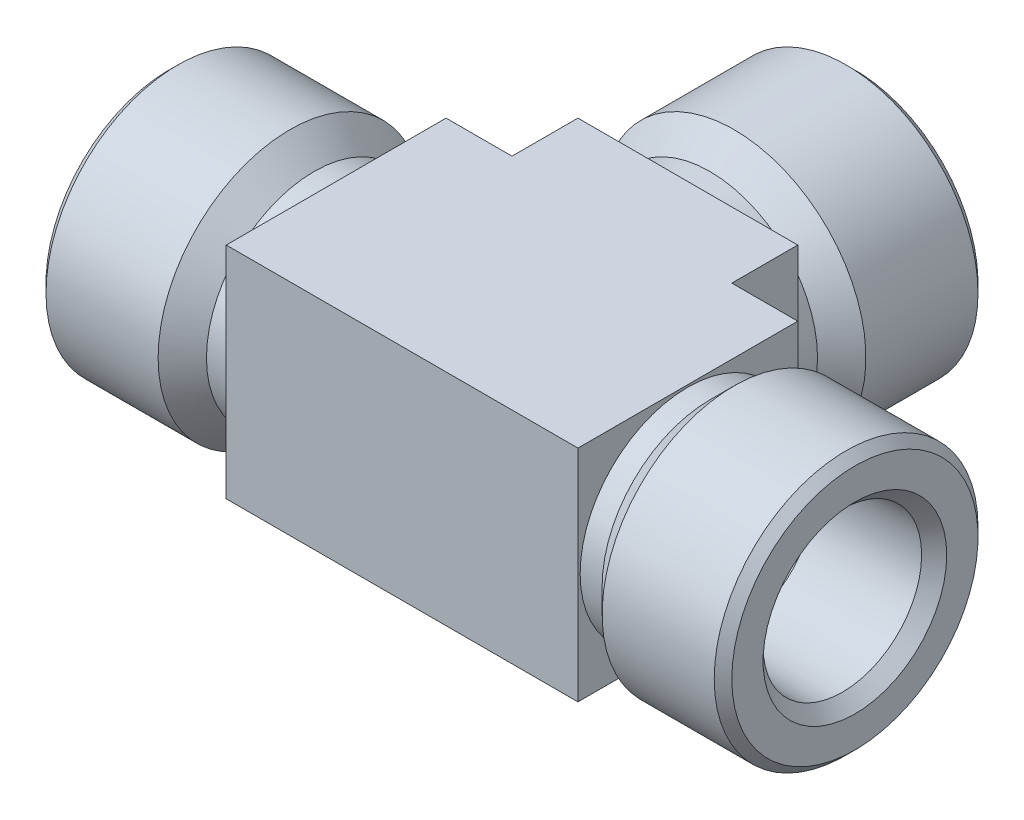
ISO-10303-21;
HEADER;
FILE_DESCRIPTION(('STEP AP214'),'2;1');
FILE_NAME('part.step','',(''),(''),'','','');
FILE_SCHEMA(('AUTOMOTIVE_DESIGN { 1 0 10303 214 1 1 1 1 }'));
ENDSEC;
DATA;
#1=APPLICATION_CONTEXT('core data for automotive mechanical design processes');
#2=APPLICATION_PROTOCOL_DEFINITION('international standard','automotive_design',2000,#1);
#3=PRODUCT_CONTEXT('',#1,'mechanical');
#4=PRODUCT('Part','Part','',(#3));
#5=PRODUCT_RELATED_PRODUCT_CATEGORY('part','',(#4));
#6=PRODUCT_DEFINITION_FORMATION('','',#4);
#7=PRODUCT_DEFINITION_CONTEXT('part definition',#1,'design');
#8=PRODUCT_DEFINITION('design','',#6,#7);
#9=PRODUCT_DEFINITION_SHAPE('','',#8);
#10=(LENGTH_UNIT() NAMED_UNIT(*) SI_UNIT(.MILLI.,.METRE.));
#11=(NAMED_UNIT(*) PLANE_ANGLE_UNIT() SI_UNIT($,.RADIAN.));
#12=(NAMED_UNIT(*) SI_UNIT($,.STERADIAN.) SOLID_ANGLE_UNIT());
#13=UNCERTAINTY_MEASURE_WITH_UNIT(LENGTH_MEASURE(1.E-05),#10,'distance_accuracy_value','');
#14=(GEOMETRIC_REPRESENTATION_CONTEXT(3) GLOBAL_UNCERTAINTY_ASSIGNED_CONTEXT((#13)) GLOBAL_UNIT_ASSIGNED_CONTEXT((#10,
#11,#12)) REPRESENTATION_CONTEXT('',''));
#15=CARTESIAN_POINT('',(0.,0.,0.));
#16=DIRECTION('',(0.,0.,1.));
#17=DIRECTION('',(1.,0.,0.));
#18=AXIS2_PLACEMENT_3D('',#15,#16,#17);
#19=CARTESIAN_POINT('',(26.924,12.7,0.));
#20=DIRECTION('',(-1.,0.,0.));
#21=DIRECTION('',(0.,0.,1.));
#22=AXIS2_PLACEMENT_3D('',#19,#20,#21);
#23=PLANE('',#22);
#24=DIRECTION('',(0.,1.,0.));
#25=VECTOR('',#24,1.);
#26=CARTESIAN_POINT('',(26.924,12.7,-12.7));
#27=LINE('',#26,#25);
#28=CARTESIAN_POINT('',(26.924,12.7,-12.7));
#29=VERTEX_POINT('',#28);
#30=CARTESIAN_POINT('',(26.924,-12.7,-12.7));
#31=VERTEX_POINT('',#30);
#32=EDGE_CURVE('E159',#29,#31,#27,.F.);
#33=ORIENTED_EDGE('',*,*,#32,.F.);
#34=DIRECTION('',(0.,0.,1.));
#35=VECTOR('',#34,1.);
#36=CARTESIAN_POINT('',(26.924,12.7,12.7));
#37=LINE('',#36,#35);
#38=CARTESIAN_POINT('',(26.924,12.7,-20.32));
#39=VERTEX_POINT('',#38);
#40=EDGE_CURVE('E149',#39,#29,#37,.T.);
#41=ORIENTED_EDGE('',*,*,#40,.F.);
#42=DIRECTION('',(0.,1.,0.));
#43=VECTOR('',#42,1.);
#44=CARTESIAN_POINT('',(26.924,0.,-20.32));
#45=LINE('',#44,#43);
#46=CARTESIAN_POINT('',(26.924,-12.7,-20.32));
#47=VERTEX_POINT('',#46);
#48=EDGE_CURVE('E163',#47,#39,#45,.T.);
#49=ORIENTED_EDGE('',*,*,#48,.F.);
#50=DIRECTION('',(0.,0.,1.));
#51=VECTOR('',#50,1.);
#52=CARTESIAN_POINT('',(26.924,-12.7,-12.7));
#53=LINE('',#52,#51);
#54=EDGE_CURVE('E145',#31,#47,#53,.F.);
#55=ORIENTED_EDGE('',*,*,#54,.F.);
#56=EDGE_LOOP('',(#33,#41,#49,#55));
#57=FACE_BOUND('',#56,.T.);
#58=ADVANCED_FACE('F17',(#57),#23,.T.);
#59=CARTESIAN_POINT('',(52.324,-12.7,0.));
#60=DIRECTION('',(1.,0.,0.));
#61=DIRECTION('',(0.,0.,-1.));
#62=AXIS2_PLACEMENT_3D('',#59,#60,#61);
#63=PLANE('',#62);
#64=DIRECTION('',(0.,1.,0.));
#65=VECTOR('',#64,1.);
#66=CARTESIAN_POINT('',(52.324,0.,-20.32));
#67=LINE('',#66,#65);
#68=CARTESIAN_POINT('',(52.324,12.7,-20.32));
#69=VERTEX_POINT('',#68);
#70=CARTESIAN_POINT('',(52.324,-12.7,-20.32));
#71=VERTEX_POINT('',#70);
#72=EDGE_CURVE('E161',#69,#71,#67,.F.);
#73=ORIENTED_EDGE('',*,*,#72,.F.);
#74=DIRECTION('',(0.,0.,1.));
#75=VECTOR('',#74,1.);
#76=CARTESIAN_POINT('',(52.324,12.7,12.7));
#77=LINE('',#76,#75);
#78=CARTESIAN_POINT('',(52.324,12.7,-12.7));
#79=VERTEX_POINT('',#78);
#80=EDGE_CURVE('E155',#79,#69,#77,.F.);
#81=ORIENTED_EDGE('',*,*,#80,.F.);
#82=DIRECTION('',(0.,1.,0.));
#83=VECTOR('',#82,1.);
#84=CARTESIAN_POINT('',(52.324,12.7,-12.7));
#85=LINE('',#84,#83);
#86=CARTESIAN_POINT('',(52.324,-12.7,-12.7));
#87=VERTEX_POINT('',#86);
#88=EDGE_CURVE('E135',#87,#79,#85,.T.);
#89=ORIENTED_EDGE('',*,*,#88,.F.);
#90=DIRECTION('',(0.,0.,1.));
#91=VECTOR('',#90,1.);
#92=CARTESIAN_POINT('',(52.324,-12.7,-12.7));
#93=LINE('',#92,#91);
#94=EDGE_CURVE('E103',#71,#87,#93,.T.);
#95=ORIENTED_EDGE('',*,*,#94,.F.);
#96=EDGE_LOOP('',(#73,#81,#89,#95));
#97=FACE_BOUND('',#96,.T.);
#98=ADVANCED_FACE('F342',(#97),#63,.T.);
#99=CARTESIAN_POINT('',(45.974,0.,-20.32));
#100=DIRECTION('',(0.,0.,-1.));
#101=DIRECTION('',(-1.,0.,0.));
#102=AXIS2_PLACEMENT_3D('',#99,#100,#101);
#103=PLANE('',#102);
#104=DIRECTION('',(-1.,0.,0.));
#105=VECTOR('',#104,1.);
#106=CARTESIAN_POINT('',(19.304,12.7,-20.32));
#107=LINE('',#106,#105);
#108=EDGE_CURVE('E152',#69,#39,#107,.T.);
#109=ORIENTED_EDGE('',*,*,#108,.F.);
#110=ORIENTED_EDGE('',*,*,#72,.T.);
#111=DIRECTION('',(1.,0.,0.));
#112=VECTOR('',#111,1.);
#113=CARTESIAN_POINT('',(19.304,-12.7,-20.32));
#114=LINE('',#113,#112);
#115=EDGE_CURVE('E143',#47,#71,#114,.T.);
#116=ORIENTED_EDGE('',*,*,#115,.F.);
#117=ORIENTED_EDGE('',*,*,#48,.T.);
#118=EDGE_LOOP('',(#109,#110,#116,#117));
#119=FACE_BOUND('',#118,.T.);
#120=CARTESIAN_POINT('',(39.624,0.,-20.32));
#121=DIRECTION('',(0.,0.,-1.));
#122=DIRECTION('',(-1.,0.,0.));
#123=AXIS2_PLACEMENT_3D('',#120,#121,#122);
#124=CIRCLE('',#123,12.446);
#125=CARTESIAN_POINT('',(27.178,0.,-20.32));
#126=VERTEX_POINT('',#125);
#127=EDGE_CURVE('E20',#126,#126,#124,.T.);
#128=ORIENTED_EDGE('',*,*,#127,.F.);
#129=EDGE_LOOP('',(#128));
#130=FACE_BOUND('',#129,.T.);
#131=ADVANCED_FACE('F339',(#119,#130),#103,.T.);
#132=CARTESIAN_POINT('',(19.304,12.7,-12.7));
#133=DIRECTION('',(0.,0.,-1.));
#134=DIRECTION('',(-1.,0.,0.));
#135=AXIS2_PLACEMENT_3D('',#132,#133,#134);
#136=PLANE('',#135);
#137=DIRECTION('',(0.,1.,0.));
#138=VECTOR('',#137,1.);
#139=CARTESIAN_POINT('',(19.304,0.,-12.7));
#140=LINE('',#139,#138);
#141=CARTESIAN_POINT('',(19.304,12.7,-12.7));
#142=VERTEX_POINT('',#141);
#143=CARTESIAN_POINT('',(19.304,-12.7,-12.7));
#144=VERTEX_POINT('',#143);
#145=EDGE_CURVE('E122',#142,#144,#140,.F.);
#146=ORIENTED_EDGE('',*,*,#145,.F.);
#147=DIRECTION('',(-1.,0.,0.));
#148=VECTOR('',#147,1.);
#149=CARTESIAN_POINT('',(19.304,12.7,-12.7));
#150=LINE('',#149,#148);
#151=EDGE_CURVE('E157',#29,#142,#150,.T.);
#152=ORIENTED_EDGE('',*,*,#151,.F.);
#153=ORIENTED_EDGE('',*,*,#32,.T.);
#154=DIRECTION('',(1.,0.,0.));
#155=VECTOR('',#154,1.);
#156=CARTESIAN_POINT('',(19.304,-12.7,-12.7));
#157=LINE('',#156,#155);
#158=EDGE_CURVE('E137',#144,#31,#157,.T.);
#159=ORIENTED_EDGE('',*,*,#158,.F.);
#160=EDGE_LOOP('',(#146,#152,#153,#159));
#161=FACE_BOUND('',#160,.T.);
#162=ADVANCED_FACE('F341',(#161),#136,.T.);
#163=CARTESIAN_POINT('',(19.304,12.7,12.7));
#164=DIRECTION('',(0.,1.,0.));
#165=DIRECTION('',(-1.,0.,0.));
#166=AXIS2_PLACEMENT_3D('',#163,#164,#165);
#167=PLANE('',#166);
#168=ORIENTED_EDGE('',*,*,#108,.T.);
#169=ORIENTED_EDGE('',*,*,#40,.T.);
#170=ORIENTED_EDGE('',*,*,#151,.T.);
#171=DIRECTION('',(0.,0.,1.));
#172=VECTOR('',#171,1.);
#173=CARTESIAN_POINT('',(19.304,12.7,-6.35));
#174=LINE('',#173,#172);
#175=CARTESIAN_POINT('',(19.304,12.7,12.7));
#176=VERTEX_POINT('',#175);
#177=EDGE_CURVE('E125',#176,#142,#174,.F.);
#178=ORIENTED_EDGE('',*,*,#177,.F.);
#179=DIRECTION('',(1.,0.,0.));
#180=VECTOR('',#179,1.);
#181=CARTESIAN_POINT('',(19.304,12.7,12.7));
#182=LINE('',#181,#180);
#183=CARTESIAN_POINT('',(59.944,12.7,12.7));
#184=VERTEX_POINT('',#183);
#185=EDGE_CURVE('E147',#184,#176,#182,.F.);
#186=ORIENTED_EDGE('',*,*,#185,.F.);
#187=DIRECTION('',(0.,0.,-1.));
#188=VECTOR('',#187,1.);
#189=CARTESIAN_POINT('',(59.944,12.7,-6.35));
#190=LINE('',#189,#188);
#191=CARTESIAN_POINT('',(59.944,12.7,-12.7));
#192=VERTEX_POINT('',#191);
#193=EDGE_CURVE('E120',#192,#184,#190,.F.);
#194=ORIENTED_EDGE('',*,*,#193,.F.);
#195=DIRECTION('',(-1.,0.,0.));
#196=VECTOR('',#195,1.);
#197=CARTESIAN_POINT('',(19.304,12.7,-12.7));
#198=LINE('',#197,#196);
#199=EDGE_CURVE('E106',#79,#192,#198,.F.);
#200=ORIENTED_EDGE('',*,*,#199,.F.);
#201=ORIENTED_EDGE('',*,*,#80,.T.);
#202=EDGE_LOOP('',(#168,#169,#170,#178,#186,#194,#200,#201));
#203=FACE_BOUND('',#202,.T.);
#204=ADVANCED_FACE('F349',(#203),#167,.T.);
#205=CARTESIAN_POINT('',(19.304,-12.7,12.7));
#206=DIRECTION('',(0.,0.,1.));
#207=DIRECTION('',(1.,0.,0.));
#208=AXIS2_PLACEMENT_3D('',#205,#206,#207);
#209=PLANE('',#208);
#210=DIRECTION('',(0.,1.,0.));
#211=VECTOR('',#210,1.);
#212=CARTESIAN_POINT('',(59.944,0.,12.7));
#213=LINE('',#212,#211);
#214=CARTESIAN_POINT('',(59.944,-12.7,12.7));
#215=VERTEX_POINT('',#214);
#216=EDGE_CURVE('E93',#184,#215,#213,.F.);
#217=ORIENTED_EDGE('',*,*,#216,.F.);
#218=ORIENTED_EDGE('',*,*,#185,.T.);
#219=DIRECTION('',(0.,1.,0.));
#220=VECTOR('',#219,1.);
#221=CARTESIAN_POINT('',(19.304,0.,12.7));
#222=LINE('',#221,#220);
#223=CARTESIAN_POINT('',(19.304,-12.7,12.7));
#224=VERTEX_POINT('',#223);
#225=EDGE_CURVE('E128',#224,#176,#222,.T.);
#226=ORIENTED_EDGE('',*,*,#225,.F.);
#227=DIRECTION('',(1.,0.,0.));
#228=VECTOR('',#227,1.);
#229=CARTESIAN_POINT('',(19.304,-12.7,12.7));
#230=LINE('',#229,#228);
#231=EDGE_CURVE('E140',#215,#224,#230,.F.);
#232=ORIENTED_EDGE('',*,*,#231,.F.);
#233=EDGE_LOOP('',(#217,#218,#226,#232));
#234=FACE_BOUND('',#233,.T.);
#235=ADVANCED_FACE('F357',(#234),#209,.T.);
#236=CARTESIAN_POINT('',(19.304,-12.7,-12.7));
#237=DIRECTION('',(0.,-1.,0.));
#238=DIRECTION('',(1.,0.,0.));
#239=AXIS2_PLACEMENT_3D('',#236,#237,#238);
#240=PLANE('',#239);
#241=DIRECTION('',(0.,0.,1.));
#242=VECTOR('',#241,1.);
#243=CARTESIAN_POINT('',(19.304,-12.7,-6.35));
#244=LINE('',#243,#242);
#245=EDGE_CURVE('E131',#144,#224,#244,.T.);
#246=ORIENTED_EDGE('',*,*,#245,.F.);
#247=ORIENTED_EDGE('',*,*,#158,.T.);
#248=ORIENTED_EDGE('',*,*,#54,.T.);
#249=ORIENTED_EDGE('',*,*,#115,.T.);
#250=ORIENTED_EDGE('',*,*,#94,.T.);
#251=DIRECTION('',(-1.,0.,0.));
#252=VECTOR('',#251,1.);
#253=CARTESIAN_POINT('',(19.304,-12.7,-12.7));
#254=LINE('',#253,#252);
#255=CARTESIAN_POINT('',(59.944,-12.7,-12.7));
#256=VERTEX_POINT('',#255);
#257=EDGE_CURVE('E98',#256,#87,#254,.T.);
#258=ORIENTED_EDGE('',*,*,#257,.F.);
#259=DIRECTION('',(0.,0.,-1.));
#260=VECTOR('',#259,1.);
#261=CARTESIAN_POINT('',(59.944,-12.7,-6.35));
#262=LINE('',#261,#260);
#263=EDGE_CURVE('E85',#215,#256,#262,.T.);
#264=ORIENTED_EDGE('',*,*,#263,.F.);
#265=ORIENTED_EDGE('',*,*,#231,.T.);
#266=EDGE_LOOP('',(#246,#247,#248,#249,#250,#258,#264,#265));
#267=FACE_BOUND('',#266,.T.);
#268=ADVANCED_FACE('F100',(#267),#240,.T.);
#269=CARTESIAN_POINT('',(19.304,12.7,-12.7));
#270=DIRECTION('',(0.,0.,-1.));
#271=DIRECTION('',(-1.,0.,0.));
#272=AXIS2_PLACEMENT_3D('',#269,#270,#271);
#273=PLANE('',#272);
#274=DIRECTION('',(0.,1.,0.));
#275=VECTOR('',#274,1.);
#276=CARTESIAN_POINT('',(59.944,0.,-12.7));
#277=LINE('',#276,#275);
#278=EDGE_CURVE('E90',#256,#192,#277,.T.);
#279=ORIENTED_EDGE('',*,*,#278,.F.);
#280=ORIENTED_EDGE('',*,*,#257,.T.);
#281=ORIENTED_EDGE('',*,*,#88,.T.);
#282=ORIENTED_EDGE('',*,*,#199,.T.);
#283=EDGE_LOOP('',(#279,#280,#281,#282));
#284=FACE_BOUND('',#283,.T.);
#285=ADVANCED_FACE('F108',(#284),#273,.T.);
#286=CARTESIAN_POINT('',(39.624,0.,-21.59));
#287=DIRECTION('',(0.,0.,-1.));
#288=DIRECTION('',(-1.,0.,0.));
#289=AXIS2_PLACEMENT_3D('',#286,#287,#288);
#290=CYLINDRICAL_SURFACE('',#289,12.446);
#291=CARTESIAN_POINT('',(39.624,0.,-22.86));
#292=DIRECTION('',(0.,0.,-1.));
#293=DIRECTION('',(1.,0.,0.));
#294=AXIS2_PLACEMENT_3D('',#291,#292,#293);
#295=CIRCLE('',#294,12.446);
#296=CARTESIAN_POINT('',(52.07,0.,-22.86));
#297=VERTEX_POINT('',#296);
#298=EDGE_CURVE('E110',#297,#297,#295,.T.);
#299=ORIENTED_EDGE('',*,*,#298,.F.);
#300=EDGE_LOOP('',(#299));
#301=FACE_BOUND('',#300,.T.);
#302=ORIENTED_EDGE('',*,*,#127,.T.);
#303=EDGE_LOOP('',(#302));
#304=FACE_BOUND('',#303,.T.);
#305=ADVANCED_FACE('F216',(#301,#304),#290,.T.);
#306=CARTESIAN_POINT('',(19.304,0.,-6.35));
#307=DIRECTION('',(-1.,0.,0.));
#308=DIRECTION('',(0.,0.,1.));
#309=AXIS2_PLACEMENT_3D('',#306,#307,#308);
#310=PLANE('',#309);
#311=ORIENTED_EDGE('',*,*,#177,.T.);
#312=ORIENTED_EDGE('',*,*,#145,.T.);
#313=ORIENTED_EDGE('',*,*,#245,.T.);
#314=ORIENTED_EDGE('',*,*,#225,.T.);
#315=EDGE_LOOP('',(#311,#312,#313,#314));
#316=FACE_BOUND('',#315,.T.);
#317=CARTESIAN_POINT('',(19.304,0.,0.));
#318=DIRECTION('',(-1.,0.,0.));
#319=DIRECTION('',(0.,0.,1.));
#320=AXIS2_PLACEMENT_3D('',#317,#318,#319);
#321=CIRCLE('',#320,12.446);
#322=CARTESIAN_POINT('',(19.304,0.,12.446));
#323=VERTEX_POINT('',#322);
#324=EDGE_CURVE('E113',#323,#323,#321,.T.);
#325=ORIENTED_EDGE('',*,*,#324,.F.);
#326=EDGE_LOOP('',(#325));
#327=FACE_BOUND('',#326,.T.);
#328=ADVANCED_FACE('F214',(#316,#327),#310,.T.);
#329=CARTESIAN_POINT('',(59.944,0.,-6.35));
#330=DIRECTION('',(1.,0.,0.));
#331=DIRECTION('',(0.,0.,-1.));
#332=AXIS2_PLACEMENT_3D('',#329,#330,#331);
#333=PLANE('',#332);
#334=ORIENTED_EDGE('',*,*,#263,.T.);
#335=ORIENTED_EDGE('',*,*,#278,.T.);
#336=ORIENTED_EDGE('',*,*,#193,.T.);
#337=ORIENTED_EDGE('',*,*,#216,.T.);
#338=EDGE_LOOP('',(#334,#335,#336,#337));
#339=FACE_BOUND('',#338,.T.);
#340=CARTESIAN_POINT('',(59.944,0.,0.));
#341=DIRECTION('',(1.,0.,0.));
#342=DIRECTION('',(0.,0.,-1.));
#343=AXIS2_PLACEMENT_3D('',#340,#341,#342);
#344=CIRCLE('',#343,12.446);
#345=CARTESIAN_POINT('',(59.944,0.,-12.446));
#346=VERTEX_POINT('',#345);
#347=EDGE_CURVE('E206',#346,#346,#344,.T.);
#348=ORIENTED_EDGE('',*,*,#347,.F.);
#349=EDGE_LOOP('',(#348));
#350=FACE_BOUND('',#349,.T.);
#351=ADVANCED_FACE('F87',(#339,#350),#333,.T.);
#352=CARTESIAN_POINT('',(39.624,0.,-25.654));
#353=DIRECTION('',(0.,0.,-1.));
#354=DIRECTION('',(0.,1.,0.));
#355=AXIS2_PLACEMENT_3D('',#352,#353,#354);
#356=CONICAL_SURFACE('',#355,15.24,0.785398163397448);
#357=CARTESIAN_POINT('',(39.624,0.,-25.654));
#358=DIRECTION('',(0.,0.,-1.));
#359=DIRECTION('',(-1.,0.,0.));
#360=AXIS2_PLACEMENT_3D('',#357,#358,#359);
#361=CIRCLE('',#360,15.24);
#362=CARTESIAN_POINT('',(24.384,0.,-25.654));
#363=VERTEX_POINT('',#362);
#364=EDGE_CURVE('E116',#363,#363,#361,.T.);
#365=ORIENTED_EDGE('',*,*,#364,.F.);
#366=EDGE_LOOP('',(#365));
#367=FACE_BOUND('',#366,.T.);
#368=ORIENTED_EDGE('',*,*,#298,.T.);
#369=EDGE_LOOP('',(#368));
#370=FACE_BOUND('',#369,.T.);
#371=ADVANCED_FACE('F224',(#367,#370),#356,.T.);
#372=CARTESIAN_POINT('',(18.034,0.,0.));
#373=DIRECTION('',(-1.,0.,0.));
#374=DIRECTION('',(0.,0.,1.));
#375=AXIS2_PLACEMENT_3D('',#372,#373,#374);
#376=CYLINDRICAL_SURFACE('',#375,12.446);
#377=ORIENTED_EDGE('',*,*,#324,.T.);
#378=EDGE_LOOP('',(#377));
#379=FACE_BOUND('',#378,.T.);
#380=CARTESIAN_POINT('',(16.764,0.,0.));
#381=DIRECTION('',(-1.,0.,0.));
#382=DIRECTION('',(0.,0.,-1.));
#383=AXIS2_PLACEMENT_3D('',#380,#381,#382);
#384=CIRCLE('',#383,12.446);
#385=CARTESIAN_POINT('',(16.764,0.,-12.446));
#386=VERTEX_POINT('',#385);
#387=EDGE_CURVE('E771',#386,#386,#384,.T.);
#388=ORIENTED_EDGE('',*,*,#387,.F.);
#389=EDGE_LOOP('',(#388));
#390=FACE_BOUND('',#389,.T.);
#391=ADVANCED_FACE('F211',(#379,#390),#376,.T.);
#392=CARTESIAN_POINT('',(61.214,0.,0.));
#393=DIRECTION('',(1.,0.,0.));
#394=DIRECTION('',(0.,0.,-1.));
#395=AXIS2_PLACEMENT_3D('',#392,#393,#394);
#396=CYLINDRICAL_SURFACE('',#395,12.446);
#397=ORIENTED_EDGE('',*,*,#347,.T.);
#398=EDGE_LOOP('',(#397));
#399=FACE_BOUND('',#398,.T.);
#400=CARTESIAN_POINT('',(62.484,0.,0.));
#401=DIRECTION('',(1.,0.,0.));
#402=DIRECTION('',(0.,0.,1.));
#403=AXIS2_PLACEMENT_3D('',#400,#401,#402);
#404=CIRCLE('',#403,12.446);
#405=CARTESIAN_POINT('',(62.484,0.,12.446));
#406=VERTEX_POINT('',#405);
#407=EDGE_CURVE('E773',#406,#406,#404,.T.);
#408=ORIENTED_EDGE('',*,*,#407,.F.);
#409=EDGE_LOOP('',(#408));
#410=FACE_BOUND('',#409,.T.);
#411=ADVANCED_FACE('F320',(#399,#410),#396,.T.);
#412=CARTESIAN_POINT('',(39.624,0.,-31.242));
#413=DIRECTION('',(0.,0.,-1.));
#414=DIRECTION('',(-1.,0.,0.));
#415=AXIS2_PLACEMENT_3D('',#412,#413,#414);
#416=CYLINDRICAL_SURFACE('',#415,15.24);
#417=CARTESIAN_POINT('',(39.624,0.,-38.608));
#418=DIRECTION('',(0.,0.,1.));
#419=DIRECTION('',(1.,0.,0.));
#420=AXIS2_PLACEMENT_3D('',#417,#418,#419);
#421=CIRCLE('',#420,15.24);
#422=CARTESIAN_POINT('',(54.864,0.,-38.608));
#423=VERTEX_POINT('',#422);
#424=EDGE_CURVE('E776',#423,#423,#421,.F.);
#425=ORIENTED_EDGE('',*,*,#424,.F.);
#426=EDGE_LOOP('',(#425));
#427=FACE_BOUND('',#426,.T.);
#428=ORIENTED_EDGE('',*,*,#364,.T.);
#429=EDGE_LOOP('',(#428));
#430=FACE_BOUND('',#429,.T.);
#431=ADVANCED_FACE('F316',(#427,#430),#416,.T.);
#432=CARTESIAN_POINT('',(13.97,0.,0.));
#433=DIRECTION('',(-1.,0.,0.));
#434=DIRECTION('',(0.,0.,1.));
#435=AXIS2_PLACEMENT_3D('',#432,#433,#434);
#436=CONICAL_SURFACE('',#435,15.24,0.785398163397447);
#437=ORIENTED_EDGE('',*,*,#387,.T.);
#438=EDGE_LOOP('',(#437));
#439=FACE_BOUND('',#438,.T.);
#440=CARTESIAN_POINT('',(13.97,0.,0.));
#441=DIRECTION('',(-1.,0.,0.));
#442=DIRECTION('',(0.,0.,1.));
#443=AXIS2_PLACEMENT_3D('',#440,#441,#442);
#444=CIRCLE('',#443,15.24);
#445=CARTESIAN_POINT('',(13.97,0.,15.24));
#446=VERTEX_POINT('',#445);
#447=EDGE_CURVE('E781',#446,#446,#444,.T.);
#448=ORIENTED_EDGE('',*,*,#447,.F.);
#449=EDGE_LOOP('',(#448));
#450=FACE_BOUND('',#449,.T.);
#451=ADVANCED_FACE('F312',(#439,#450),#436,.T.);
#452=CARTESIAN_POINT('',(65.278,0.,0.));
#453=DIRECTION('',(1.,0.,0.));
#454=DIRECTION('',(0.,0.,-1.));
#455=AXIS2_PLACEMENT_3D('',#452,#453,#454);
#456=CONICAL_SURFACE('',#455,15.24,0.785398163397448);
#457=ORIENTED_EDGE('',*,*,#407,.T.);
#458=EDGE_LOOP('',(#457));
#459=FACE_BOUND('',#458,.T.);
#460=CARTESIAN_POINT('',(65.278,0.,0.));
#461=DIRECTION('',(1.,0.,0.));
#462=DIRECTION('',(0.,0.,-1.));
#463=AXIS2_PLACEMENT_3D('',#460,#461,#462);
#464=CIRCLE('',#463,15.24);
#465=CARTESIAN_POINT('',(65.278,0.,-15.24));
#466=VERTEX_POINT('',#465);
#467=EDGE_CURVE('E205',#466,#466,#464,.T.);
#468=ORIENTED_EDGE('',*,*,#467,.F.);
#469=EDGE_LOOP('',(#468));
#470=FACE_BOUND('',#469,.T.);
#471=ADVANCED_FACE('F308',(#459,#470),#456,.T.);
#472=CARTESIAN_POINT('',(39.624,0.,-38.608));
#473=DIRECTION('',(0.,0.,1.));
#474=DIRECTION('',(0.,-1.,0.));
#475=AXIS2_PLACEMENT_3D('',#472,#473,#474);
#476=CONICAL_SURFACE('',#475,15.24,0.785398163397448);
#477=CARTESIAN_POINT('',(39.624,0.,-39.624));
#478=DIRECTION('',(0.,0.,1.));
#479=DIRECTION('',(0.,-1.,0.));
#480=AXIS2_PLACEMENT_3D('',#477,#478,#479);
#481=CIRCLE('',#480,14.224);
#482=CARTESIAN_POINT('',(39.624,-14.224,-39.624));
#483=VERTEX_POINT('',#482);
#484=EDGE_CURVE('E201',#483,#483,#481,.F.);
#485=ORIENTED_EDGE('',*,*,#484,.F.);
#486=EDGE_LOOP('',(#485));
#487=FACE_BOUND('',#486,.T.);
#488=ORIENTED_EDGE('',*,*,#424,.T.);
#489=EDGE_LOOP('',(#488));
#490=FACE_BOUND('',#489,.T.);
#491=ADVANCED_FACE('F304',(#487,#490),#476,.T.);
#492=CARTESIAN_POINT('',(8.382,0.,0.));
#493=DIRECTION('',(-1.,0.,0.));
#494=DIRECTION('',(0.,0.,1.));
#495=AXIS2_PLACEMENT_3D('',#492,#493,#494);
#496=CYLINDRICAL_SURFACE('',#495,15.24);
#497=ORIENTED_EDGE('',*,*,#447,.T.);
#498=EDGE_LOOP('',(#497));
#499=FACE_BOUND('',#498,.T.);
#500=CARTESIAN_POINT('',(1.016,0.,0.));
#501=DIRECTION('',(1.,0.,0.));
#502=DIRECTION('',(0.,0.,1.));
#503=AXIS2_PLACEMENT_3D('',#500,#501,#502);
#504=CIRCLE('',#503,15.24);
#505=CARTESIAN_POINT('',(1.01599999999999,0.,15.24));
#506=VERTEX_POINT('',#505);
#507=EDGE_CURVE('E204',#506,#506,#504,.F.);
#508=ORIENTED_EDGE('',*,*,#507,.F.);
#509=EDGE_LOOP('',(#508));
#510=FACE_BOUND('',#509,.T.);
#511=ADVANCED_FACE('F300',(#499,#510),#496,.T.);
#512=CARTESIAN_POINT('',(70.866,0.,0.));
#513=DIRECTION('',(1.,0.,0.));
#514=DIRECTION('',(0.,0.,-1.));
#515=AXIS2_PLACEMENT_3D('',#512,#513,#514);
#516=CYLINDRICAL_SURFACE('',#515,15.24);
#517=ORIENTED_EDGE('',*,*,#467,.T.);
#518=EDGE_LOOP('',(#517));
#519=FACE_BOUND('',#518,.T.);
#520=CARTESIAN_POINT('',(78.232,0.,0.));
#521=DIRECTION('',(-1.,0.,0.));
#522=DIRECTION('',(0.,0.,-1.));
#523=AXIS2_PLACEMENT_3D('',#520,#521,#522);
#524=CIRCLE('',#523,15.24);
#525=CARTESIAN_POINT('',(78.232,0.,-15.24));
#526=VERTEX_POINT('',#525);
#527=EDGE_CURVE('E200',#526,#526,#524,.F.);
#528=ORIENTED_EDGE('',*,*,#527,.F.);
#529=EDGE_LOOP('',(#528));
#530=FACE_BOUND('',#529,.T.);
#531=ADVANCED_FACE('F296',(#519,#530),#516,.T.);
#532=CARTESIAN_POINT('',(47.244,0.,-39.624));
#533=DIRECTION('',(0.,0.,-1.));
#534=DIRECTION('',(-1.,0.,0.));
#535=AXIS2_PLACEMENT_3D('',#532,#533,#534);
#536=PLANE('',#535);
#537=CARTESIAN_POINT('',(39.624,0.,-39.624));
#538=DIRECTION('',(0.,0.,-1.));
#539=DIRECTION('',(-1.,0.,0.));
#540=AXIS2_PLACEMENT_3D('',#537,#538,#539);
#541=CIRCLE('',#540,10.611739);
#542=CARTESIAN_POINT('',(29.012261,0.,-39.624));
#543=VERTEX_POINT('',#542);
#544=EDGE_CURVE('E197',#543,#543,#541,.F.);
#545=ORIENTED_EDGE('',*,*,#544,.T.);
#546=EDGE_LOOP('',(#545));
#547=FACE_BOUND('',#546,.T.);
#548=ORIENTED_EDGE('',*,*,#484,.T.);
#549=EDGE_LOOP('',(#548));
#550=FACE_BOUND('',#549,.T.);
#551=ADVANCED_FACE('F292',(#547,#550),#536,.T.);
#552=CARTESIAN_POINT('',(1.016,0.,0.));
#553=DIRECTION('',(1.,0.,0.));
#554=DIRECTION('',(0.,0.,-1.));
#555=AXIS2_PLACEMENT_3D('',#552,#553,#554);
#556=CONICAL_SURFACE('',#555,15.24,0.785398163397449);
#557=CARTESIAN_POINT('',(0.,0.,0.));
#558=DIRECTION('',(1.,0.,0.));
#559=DIRECTION('',(0.,0.,-1.));
#560=AXIS2_PLACEMENT_3D('',#557,#558,#559);
#561=CIRCLE('',#560,14.224);
#562=CARTESIAN_POINT('',(0.,0.,-14.224));
#563=VERTEX_POINT('',#562);
#564=EDGE_CURVE('E194',#563,#563,#561,.F.);
#565=ORIENTED_EDGE('',*,*,#564,.F.);
#566=EDGE_LOOP('',(#565));
#567=FACE_BOUND('',#566,.T.);
#568=ORIENTED_EDGE('',*,*,#507,.T.);
#569=EDGE_LOOP('',(#568));
#570=FACE_BOUND('',#569,.T.);
#571=ADVANCED_FACE('F288',(#567,#570),#556,.T.);
#572=CARTESIAN_POINT('',(78.232,0.,0.));
#573=DIRECTION('',(-1.,0.,0.));
#574=DIRECTION('',(0.,0.,1.));
#575=AXIS2_PLACEMENT_3D('',#572,#573,#574);
#576=CONICAL_SURFACE('',#575,15.24,0.785398163397448);
#577=CARTESIAN_POINT('',(79.248,0.,0.));
#578=DIRECTION('',(-1.,0.,0.));
#579=DIRECTION('',(0.,0.,1.));
#580=AXIS2_PLACEMENT_3D('',#577,#578,#579);
#581=CIRCLE('',#580,14.224);
#582=CARTESIAN_POINT('',(79.248,0.,14.224));
#583=VERTEX_POINT('',#582);
#584=EDGE_CURVE('E191',#583,#583,#581,.F.);
#585=ORIENTED_EDGE('',*,*,#584,.F.);
#586=EDGE_LOOP('',(#585));
#587=FACE_BOUND('',#586,.T.);
#588=ORIENTED_EDGE('',*,*,#527,.T.);
#589=EDGE_LOOP('',(#588));
#590=FACE_BOUND('',#589,.T.);
#591=ADVANCED_FACE('F284',(#587,#590),#576,.T.);
#592=CARTESIAN_POINT('',(39.624,0.,-39.624));
#593=DIRECTION('',(0.,0.,-1.));
#594=DIRECTION('',(-1.,0.,0.));
#595=AXIS2_PLACEMENT_3D('',#592,#593,#594);
#596=CONICAL_SURFACE('',#595,10.611739,0.785398163397448);
#597=CARTESIAN_POINT('',(39.624,0.,-38.172644));
#598=DIRECTION('',(0.,0.,-1.));
#599=DIRECTION('',(1.,0.,0.));
#600=AXIS2_PLACEMENT_3D('',#597,#598,#599);
#601=CIRCLE('',#600,9.160383);
#602=CARTESIAN_POINT('',(48.784383,0.,-38.172644));
#603=VERTEX_POINT('',#602);
#604=EDGE_CURVE('E190',#603,#603,#601,.F.);
#605=ORIENTED_EDGE('',*,*,#604,.T.);
#606=EDGE_LOOP('',(#605));
#607=FACE_BOUND('',#606,.T.);
#608=ORIENTED_EDGE('',*,*,#544,.F.);
#609=EDGE_LOOP('',(#608));
#610=FACE_BOUND('',#609,.T.);
#611=ADVANCED_FACE('F280',(#607,#610),#596,.F.);
#612=CARTESIAN_POINT('',(0.,0.,-7.62));
#613=DIRECTION('',(-1.,0.,0.));
#614=DIRECTION('',(0.,0.,1.));
#615=AXIS2_PLACEMENT_3D('',#612,#613,#614);
#616=PLANE('',#615);
#617=CARTESIAN_POINT('',(0.,0.,0.));
#618=DIRECTION('',(-1.,0.,0.));
#619=DIRECTION('',(0.,0.,1.));
#620=AXIS2_PLACEMENT_3D('',#617,#618,#619);
#621=CIRCLE('',#620,10.611739);
#622=CARTESIAN_POINT('',(0.,0.,10.611739));
#623=VERTEX_POINT('',#622);
#624=EDGE_CURVE('E187',#623,#623,#621,.F.);
#625=ORIENTED_EDGE('',*,*,#624,.T.);
#626=EDGE_LOOP('',(#625));
#627=FACE_BOUND('',#626,.T.);
#628=ORIENTED_EDGE('',*,*,#564,.T.);
#629=EDGE_LOOP('',(#628));
#630=FACE_BOUND('',#629,.T.);
#631=ADVANCED_FACE('F276',(#627,#630),#616,.T.);
#632=CARTESIAN_POINT('',(79.248,0.,7.62));
#633=DIRECTION('',(1.,0.,0.));
#634=DIRECTION('',(0.,0.,-1.));
#635=AXIS2_PLACEMENT_3D('',#632,#633,#634);
#636=PLANE('',#635);
#637=CARTESIAN_POINT('',(79.248,0.,0.));
#638=DIRECTION('',(1.,0.,0.));
#639=DIRECTION('',(0.,0.,-1.));
#640=AXIS2_PLACEMENT_3D('',#637,#638,#639);
#641=CIRCLE('',#640,10.611739);
#642=CARTESIAN_POINT('',(79.248,0.,-10.611739));
#643=VERTEX_POINT('',#642);
#644=EDGE_CURVE('E184',#643,#643,#641,.F.);
#645=ORIENTED_EDGE('',*,*,#644,.T.);
#646=EDGE_LOOP('',(#645));
#647=FACE_BOUND('',#646,.T.);
#648=ORIENTED_EDGE('',*,*,#584,.T.);
#649=EDGE_LOOP('',(#648));
#650=FACE_BOUND('',#649,.T.);
#651=ADVANCED_FACE('F272',(#647,#650),#636,.T.);
#652=CARTESIAN_POINT('',(39.624,0.,-38.172644));
#653=DIRECTION('',(0.,0.,-1.));
#654=DIRECTION('',(-1.,0.,0.));
#655=AXIS2_PLACEMENT_3D('',#652,#653,#654);
#656=CONICAL_SURFACE('',#655,9.160383,0.025656340004316);
#657=CARTESIAN_POINT('',(39.624,0.,-26.05278));
#658=DIRECTION('',(0.,0.,-1.));
#659=DIRECTION('',(-1.,0.,0.));
#660=AXIS2_PLACEMENT_3D('',#657,#658,#659);
#661=CIRCLE('',#660,8.84936340276165);
#662=CARTESIAN_POINT('',(30.7746365972383,0.,-26.05278));
#663=VERTEX_POINT('',#662);
#664=EDGE_CURVE('E180',#663,#663,#661,.T.);
#665=ORIENTED_EDGE('',*,*,#664,.F.);
#666=EDGE_LOOP('',(#665));
#667=FACE_BOUND('',#666,.T.);
#668=ORIENTED_EDGE('',*,*,#604,.F.);
#669=EDGE_LOOP('',(#668));
#670=FACE_BOUND('',#669,.T.);
#671=ADVANCED_FACE('F268',(#667,#670),#656,.F.);
#672=CARTESIAN_POINT('',(0.,0.,0.));
#673=DIRECTION('',(-1.,0.,0.));
#674=DIRECTION('',(0.,0.,1.));
#675=AXIS2_PLACEMENT_3D('',#672,#673,#674);
#676=CONICAL_SURFACE('',#675,10.611739,0.785398163397448);
#677=CARTESIAN_POINT('',(1.45135600000001,0.,0.));
#678=DIRECTION('',(-1.,0.,0.));
#679=DIRECTION('',(0.,0.,-1.));
#680=AXIS2_PLACEMENT_3D('',#677,#678,#679);
#681=CIRCLE('',#680,9.160383);
#682=CARTESIAN_POINT('',(1.45135600000002,0.,-9.160383));
#683=VERTEX_POINT('',#682);
#684=EDGE_CURVE('E183',#683,#683,#681,.F.);
#685=ORIENTED_EDGE('',*,*,#684,.T.);
#686=EDGE_LOOP('',(#685));
#687=FACE_BOUND('',#686,.T.);
#688=ORIENTED_EDGE('',*,*,#624,.F.);
#689=EDGE_LOOP('',(#688));
#690=FACE_BOUND('',#689,.T.);
#691=ADVANCED_FACE('F264',(#687,#690),#676,.F.);
#692=CARTESIAN_POINT('',(79.248,0.,0.));
#693=DIRECTION('',(1.,0.,0.));
#694=DIRECTION('',(0.,0.,-1.));
#695=AXIS2_PLACEMENT_3D('',#692,#693,#694);
#696=CONICAL_SURFACE('',#695,10.611739,0.785398163397448);
#697=CARTESIAN_POINT('',(77.796644,0.,0.));
#698=DIRECTION('',(1.,0.,0.));
#699=DIRECTION('',(0.,0.,1.));
#700=AXIS2_PLACEMENT_3D('',#697,#698,#699);
#701=CIRCLE('',#700,9.160383);
#702=CARTESIAN_POINT('',(77.796644,0.,9.160383));
#703=VERTEX_POINT('',#702);
#704=EDGE_CURVE('E179',#703,#703,#701,.F.);
#705=ORIENTED_EDGE('',*,*,#704,.T.);
#706=EDGE_LOOP('',(#705));
#707=FACE_BOUND('',#706,.T.);
#708=ORIENTED_EDGE('',*,*,#644,.F.);
#709=EDGE_LOOP('',(#708));
#710=FACE_BOUND('',#709,.T.);
#711=ADVANCED_FACE('F260',(#707,#710),#696,.F.);
#712=CARTESIAN_POINT('',(39.624,0.,-26.05278));
#713=DIRECTION('',(0.,0.,1.));
#714=DIRECTION('',(1.,0.,0.));
#715=AXIS2_PLACEMENT_3D('',#712,#713,#714);
#716=PLANE('',#715);
#717=ORIENTED_EDGE('',*,*,#664,.T.);
#718=EDGE_LOOP('',(#717));
#719=FACE_BOUND('',#718,.T.);
#720=CARTESIAN_POINT('',(39.624,0.,-26.05278));
#721=DIRECTION('',(0.,0.,1.));
#722=DIRECTION('',(1.,0.,0.));
#723=AXIS2_PLACEMENT_3D('',#720,#721,#722);
#724=CIRCLE('',#723,9.271);
#725=CARTESIAN_POINT('',(48.895,0.,-26.05278));
#726=VERTEX_POINT('',#725);
#727=EDGE_CURVE('E176',#726,#726,#724,.T.);
#728=ORIENTED_EDGE('',*,*,#727,.T.);
#729=EDGE_LOOP('',(#728));
#730=FACE_BOUND('',#729,.T.);
#731=ADVANCED_FACE('F256',(#719,#730),#716,.T.);
#732=CARTESIAN_POINT('',(1.45135600000002,0.,0.));
#733=DIRECTION('',(-1.,0.,0.));
#734=DIRECTION('',(0.,0.,1.));
#735=AXIS2_PLACEMENT_3D('',#732,#733,#734);
#736=CONICAL_SURFACE('',#735,9.160383,0.0256563400043175);
#737=CARTESIAN_POINT('',(13.57122,0.,0.));
#738=DIRECTION('',(-1.,0.,0.));
#739=DIRECTION('',(0.,0.,1.));
#740=AXIS2_PLACEMENT_3D('',#737,#738,#739);
#741=CIRCLE('',#740,8.84936340276163);
#742=CARTESIAN_POINT('',(13.57122,0.,8.84936340276163));
#743=VERTEX_POINT('',#742);
#744=EDGE_CURVE('E173',#743,#743,#741,.T.);
#745=ORIENTED_EDGE('',*,*,#744,.F.);
#746=EDGE_LOOP('',(#745));
#747=FACE_BOUND('',#746,.T.);
#748=ORIENTED_EDGE('',*,*,#684,.F.);
#749=EDGE_LOOP('',(#748));
#750=FACE_BOUND('',#749,.T.);
#751=ADVANCED_FACE('F252',(#747,#750),#736,.F.);
#752=CARTESIAN_POINT('',(77.796644,0.,0.));
#753=DIRECTION('',(1.,0.,0.));
#754=DIRECTION('',(0.,0.,-1.));
#755=AXIS2_PLACEMENT_3D('',#752,#753,#754);
#756=CONICAL_SURFACE('',#755,9.160383,0.0256563400043175);
#757=CARTESIAN_POINT('',(65.67678,0.,0.));
#758=DIRECTION('',(1.,0.,0.));
#759=DIRECTION('',(0.,0.,-1.));
#760=AXIS2_PLACEMENT_3D('',#757,#758,#759);
#761=CIRCLE('',#760,8.84936340276163);
#762=CARTESIAN_POINT('',(65.67678,0.,-8.84936340276163));
#763=VERTEX_POINT('',#762);
#764=EDGE_CURVE('E170',#763,#763,#761,.T.);
#765=ORIENTED_EDGE('',*,*,#764,.F.);
#766=EDGE_LOOP('',(#765));
#767=FACE_BOUND('',#766,.T.);
#768=ORIENTED_EDGE('',*,*,#704,.F.);
#769=EDGE_LOOP('',(#768));
#770=FACE_BOUND('',#769,.T.);
#771=ADVANCED_FACE('F248',(#767,#770),#756,.F.);
#772=CARTESIAN_POINT('',(39.624,0.,-19.812));
#773=DIRECTION('',(0.,0.,1.));
#774=DIRECTION('',(1.,0.,0.));
#775=AXIS2_PLACEMENT_3D('',#772,#773,#774);
#776=CYLINDRICAL_SURFACE('',#775,9.271);
#777=CARTESIAN_POINT('',(39.624,0.,0.));
#778=DIRECTION('',(-0.707106781186548,0.,0.707106781186547));
#779=DIRECTION('',(0.707106781186547,0.,0.707106781186547));
#780=AXIS2_PLACEMENT_3D('',#777,#778,#779);
#781=ELLIPSE('',#780,13.111173936761,9.271);
#782=CARTESIAN_POINT('',(39.624,9.271,0.));
#783=VERTEX_POINT('',#782);
#784=CARTESIAN_POINT('',(39.624,-9.271,0.));
#785=VERTEX_POINT('',#784);
#786=EDGE_CURVE('E32',#783,#785,#781,.T.);
#787=ORIENTED_EDGE('',*,*,#786,.T.);
#788=CARTESIAN_POINT('',(39.624,0.,0.));
#789=DIRECTION('',(0.707106781186547,0.,0.707106781186547));
#790=DIRECTION('',(-0.707106781186548,0.,0.707106781186547));
#791=AXIS2_PLACEMENT_3D('',#788,#789,#790);
#792=ELLIPSE('',#791,13.111173936761,9.271);
#793=EDGE_CURVE('E168',#785,#783,#792,.T.);
#794=ORIENTED_EDGE('',*,*,#793,.T.);
#795=EDGE_LOOP('',(#787,#794));
#796=FACE_BOUND('',#795,.T.);
#797=ORIENTED_EDGE('',*,*,#727,.F.);
#798=EDGE_LOOP('',(#797));
#799=FACE_BOUND('',#798,.T.);
#800=ADVANCED_FACE('F244',(#796,#799),#776,.F.);
#801=CARTESIAN_POINT('',(13.57122,0.,0.));
#802=DIRECTION('',(1.,0.,0.));
#803=DIRECTION('',(0.,0.,-1.));
#804=AXIS2_PLACEMENT_3D('',#801,#802,#803);
#805=PLANE('',#804);
#806=ORIENTED_EDGE('',*,*,#744,.T.);
#807=EDGE_LOOP('',(#806));
#808=FACE_BOUND('',#807,.T.);
#809=CARTESIAN_POINT('',(13.57122,0.,0.));
#810=DIRECTION('',(1.,0.,0.));
#811=DIRECTION('',(0.,0.,-1.));
#812=AXIS2_PLACEMENT_3D('',#809,#810,#811);
#813=CIRCLE('',#812,9.271);
#814=CARTESIAN_POINT('',(13.57122,0.,-9.271));
#815=VERTEX_POINT('',#814);
#816=EDGE_CURVE('E26',#815,#815,#813,.T.);
#817=ORIENTED_EDGE('',*,*,#816,.T.);
#818=EDGE_LOOP('',(#817));
#819=FACE_BOUND('',#818,.T.);
#820=ADVANCED_FACE('F236',(#808,#819),#805,.T.);
#821=CARTESIAN_POINT('',(65.67678,0.,0.));
#822=DIRECTION('',(-1.,0.,0.));
#823=DIRECTION('',(0.,0.,1.));
#824=AXIS2_PLACEMENT_3D('',#821,#822,#823);
#825=PLANE('',#824);
#826=ORIENTED_EDGE('',*,*,#764,.T.);
#827=EDGE_LOOP('',(#826));
#828=FACE_BOUND('',#827,.T.);
#829=CARTESIAN_POINT('',(65.67678,0.,0.));
#830=DIRECTION('',(1.,0.,0.));
#831=DIRECTION('',(0.,0.,-1.));
#832=AXIS2_PLACEMENT_3D('',#829,#830,#831);
#833=CIRCLE('',#832,9.271);
#834=CARTESIAN_POINT('',(65.67678,0.,-9.271));
#835=VERTEX_POINT('',#834);
#836=EDGE_CURVE('E10',#835,#835,#833,.F.);
#837=ORIENTED_EDGE('',*,*,#836,.T.);
#838=EDGE_LOOP('',(#837));
#839=FACE_BOUND('',#838,.T.);
#840=ADVANCED_FACE('F230',(#828,#839),#825,.T.);
#841=CARTESIAN_POINT('',(39.624,0.,0.));
#842=DIRECTION('',(1.,0.,0.));
#843=DIRECTION('',(0.,0.,-1.));
#844=AXIS2_PLACEMENT_3D('',#841,#842,#843);
#845=CYLINDRICAL_SURFACE('',#844,9.271);
#846=ORIENTED_EDGE('',*,*,#816,.F.);
#847=EDGE_LOOP('',(#846));
#848=FACE_BOUND('',#847,.T.);
#849=ORIENTED_EDGE('',*,*,#836,.F.);
#850=EDGE_LOOP('',(#849));
#851=FACE_BOUND('',#850,.T.);
#852=ORIENTED_EDGE('',*,*,#793,.F.);
#853=ORIENTED_EDGE('',*,*,#786,.F.);
#854=EDGE_LOOP('',(#852,#853));
#855=FACE_BOUND('',#854,.T.);
#856=ADVANCED_FACE('F228',(#848,#851,#855),#845,.F.);
#857=CLOSED_SHELL('',(#58,#98,#131,#162,#204,#235,#268,#285,#305,#328,#351,#371,#391,#411,#431,
#451,#471,#491,#511,#531,#551,#571,#591,#611,#631,#651,#671,#691,#711,#731,#751,#771,#800,#820,
#840,#856));
#858=MANIFOLD_SOLID_BREP('B1',#857);
#859=ADVANCED_BREP_SHAPE_REPRESENTATION('',(#18,#858),#14);
#860=SHAPE_DEFINITION_REPRESENTATION(#9,#859);
ENDSEC;
END-ISO-10303-21;
